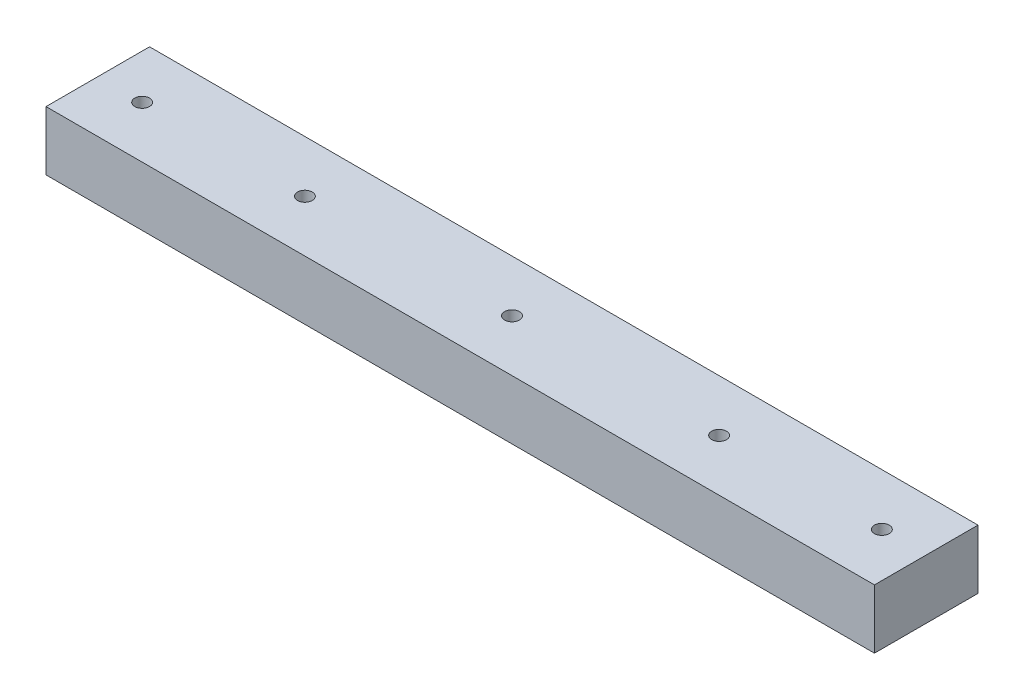
ISO-10303-21;
HEADER;
FILE_DESCRIPTION(('STEP AP214'),'2;1');
FILE_NAME('part.step','',(''),(''),'','','');
FILE_SCHEMA(('AUTOMOTIVE_DESIGN { 1 0 10303 214 1 1 1 1 }'));
ENDSEC;
DATA;
#1=APPLICATION_CONTEXT('core data for automotive mechanical design processes');
#2=APPLICATION_PROTOCOL_DEFINITION('international standard','automotive_design',2000,#1);
#3=PRODUCT_CONTEXT('',#1,'mechanical');
#4=PRODUCT('Part','Part','',(#3));
#5=PRODUCT_RELATED_PRODUCT_CATEGORY('part','',(#4));
#6=PRODUCT_DEFINITION_FORMATION('','',#4);
#7=PRODUCT_DEFINITION_CONTEXT('part definition',#1,'design');
#8=PRODUCT_DEFINITION('design','',#6,#7);
#9=PRODUCT_DEFINITION_SHAPE('','',#8);
#10=(LENGTH_UNIT() NAMED_UNIT(*) SI_UNIT(.MILLI.,.METRE.));
#11=(NAMED_UNIT(*) PLANE_ANGLE_UNIT() SI_UNIT($,.RADIAN.));
#12=(NAMED_UNIT(*) SI_UNIT($,.STERADIAN.) SOLID_ANGLE_UNIT());
#13=UNCERTAINTY_MEASURE_WITH_UNIT(LENGTH_MEASURE(1.E-05),#10,'distance_accuracy_value','');
#14=(GEOMETRIC_REPRESENTATION_CONTEXT(3) GLOBAL_UNCERTAINTY_ASSIGNED_CONTEXT((#13)) GLOBAL_UNIT_ASSIGNED_CONTEXT((#10,
#11,#12)) REPRESENTATION_CONTEXT('',''));
#15=CARTESIAN_POINT('',(0.,0.,0.));
#16=DIRECTION('',(0.,0.,1.));
#17=DIRECTION('',(1.,0.,0.));
#18=AXIS2_PLACEMENT_3D('',#15,#16,#17);
#19=CARTESIAN_POINT('',(140.,20.,-17.5));
#20=DIRECTION('',(-1.,0.,0.));
#21=DIRECTION('',(0.,0.,1.));
#22=AXIS2_PLACEMENT_3D('',#19,#20,#21);
#23=PLANE('',#22);
#24=DIRECTION('',(0.,0.,-1.));
#25=VECTOR('',#24,1.);
#26=CARTESIAN_POINT('',(140.,0.,-17.5));
#27=LINE('',#26,#25);
#28=CARTESIAN_POINT('',(140.,0.,17.5));
#29=VERTEX_POINT('',#28);
#30=CARTESIAN_POINT('',(140.,0.,-17.5));
#31=VERTEX_POINT('',#30);
#32=EDGE_CURVE('E102',#29,#31,#27,.T.);
#33=ORIENTED_EDGE('',*,*,#32,.T.);
#34=DIRECTION('',(0.,-1.,0.));
#35=VECTOR('',#34,1.);
#36=CARTESIAN_POINT('',(140.,20.,-17.5));
#37=LINE('',#36,#35);
#38=CARTESIAN_POINT('',(140.,20.,-17.5));
#39=VERTEX_POINT('',#38);
#40=EDGE_CURVE('E11',#39,#31,#37,.T.);
#41=ORIENTED_EDGE('',*,*,#40,.F.);
#42=DIRECTION('',(0.,0.,-1.));
#43=VECTOR('',#42,1.);
#44=CARTESIAN_POINT('',(140.,20.,-17.5));
#45=LINE('',#44,#43);
#46=CARTESIAN_POINT('',(140.,20.,17.5));
#47=VERTEX_POINT('',#46);
#48=EDGE_CURVE('E90',#47,#39,#45,.T.);
#49=ORIENTED_EDGE('',*,*,#48,.F.);
#50=DIRECTION('',(0.,-1.,0.));
#51=VECTOR('',#50,1.);
#52=CARTESIAN_POINT('',(140.,20.,17.5));
#53=LINE('',#52,#51);
#54=EDGE_CURVE('E98',#47,#29,#53,.T.);
#55=ORIENTED_EDGE('',*,*,#54,.T.);
#56=EDGE_LOOP('',(#33,#41,#49,#55));
#57=FACE_BOUND('',#56,.T.);
#58=ADVANCED_FACE('F39',(#57),#23,.F.);
#59=CARTESIAN_POINT('',(-140.,20.,-17.5));
#60=DIRECTION('',(0.,0.,1.));
#61=DIRECTION('',(1.,0.,0.));
#62=AXIS2_PLACEMENT_3D('',#59,#60,#61);
#63=PLANE('',#62);
#64=DIRECTION('',(-1.,0.,0.));
#65=VECTOR('',#64,1.);
#66=CARTESIAN_POINT('',(-140.,0.,-17.5));
#67=LINE('',#66,#65);
#68=CARTESIAN_POINT('',(-140.,0.,-17.5));
#69=VERTEX_POINT('',#68);
#70=EDGE_CURVE('E94',#31,#69,#67,.T.);
#71=ORIENTED_EDGE('',*,*,#70,.T.);
#72=DIRECTION('',(0.,-1.,0.));
#73=VECTOR('',#72,1.);
#74=CARTESIAN_POINT('',(-140.,20.,-17.5));
#75=LINE('',#74,#73);
#76=CARTESIAN_POINT('',(-140.,20.,-17.5));
#77=VERTEX_POINT('',#76);
#78=EDGE_CURVE('E47',#77,#69,#75,.T.);
#79=ORIENTED_EDGE('',*,*,#78,.F.);
#80=DIRECTION('',(-1.,0.,0.));
#81=VECTOR('',#80,1.);
#82=CARTESIAN_POINT('',(-140.,20.,-17.5));
#83=LINE('',#82,#81);
#84=EDGE_CURVE('E85',#39,#77,#83,.T.);
#85=ORIENTED_EDGE('',*,*,#84,.F.);
#86=ORIENTED_EDGE('',*,*,#40,.T.);
#87=EDGE_LOOP('',(#71,#79,#85,#86));
#88=FACE_BOUND('',#87,.T.);
#89=ADVANCED_FACE('F93',(#88),#63,.F.);
#90=CARTESIAN_POINT('',(-140.,20.,-17.5));
#91=DIRECTION('',(1.,0.,0.));
#92=DIRECTION('',(0.,0.,-1.));
#93=AXIS2_PLACEMENT_3D('',#90,#91,#92);
#94=PLANE('',#93);
#95=DIRECTION('',(0.,0.,1.));
#96=VECTOR('',#95,1.);
#97=CARTESIAN_POINT('',(-140.,0.,-17.5));
#98=LINE('',#97,#96);
#99=CARTESIAN_POINT('',(-140.,0.,17.5));
#100=VERTEX_POINT('',#99);
#101=EDGE_CURVE('E72',#69,#100,#98,.T.);
#102=ORIENTED_EDGE('',*,*,#101,.T.);
#103=DIRECTION('',(0.,-1.,0.));
#104=VECTOR('',#103,1.);
#105=CARTESIAN_POINT('',(-140.,20.,17.5));
#106=LINE('',#105,#104);
#107=CARTESIAN_POINT('',(-140.,20.,17.5));
#108=VERTEX_POINT('',#107);
#109=EDGE_CURVE('E95',#108,#100,#106,.T.);
#110=ORIENTED_EDGE('',*,*,#109,.F.);
#111=DIRECTION('',(0.,0.,1.));
#112=VECTOR('',#111,1.);
#113=CARTESIAN_POINT('',(-140.,20.,-17.5));
#114=LINE('',#113,#112);
#115=EDGE_CURVE('E88',#77,#108,#114,.T.);
#116=ORIENTED_EDGE('',*,*,#115,.F.);
#117=ORIENTED_EDGE('',*,*,#78,.T.);
#118=EDGE_LOOP('',(#102,#110,#116,#117));
#119=FACE_BOUND('',#118,.T.);
#120=ADVANCED_FACE('F96',(#119),#94,.F.);
#121=CARTESIAN_POINT('',(-140.,20.,17.5));
#122=DIRECTION('',(0.,0.,-1.));
#123=DIRECTION('',(-1.,0.,0.));
#124=AXIS2_PLACEMENT_3D('',#121,#122,#123);
#125=PLANE('',#124);
#126=DIRECTION('',(1.,0.,0.));
#127=VECTOR('',#126,1.);
#128=CARTESIAN_POINT('',(-140.,0.,17.5));
#129=LINE('',#128,#127);
#130=EDGE_CURVE('E78',#100,#29,#129,.T.);
#131=ORIENTED_EDGE('',*,*,#130,.T.);
#132=ORIENTED_EDGE('',*,*,#54,.F.);
#133=DIRECTION('',(1.,0.,0.));
#134=VECTOR('',#133,1.);
#135=CARTESIAN_POINT('',(-140.,20.,17.5));
#136=LINE('',#135,#134);
#137=EDGE_CURVE('E55',#108,#47,#136,.T.);
#138=ORIENTED_EDGE('',*,*,#137,.F.);
#139=ORIENTED_EDGE('',*,*,#109,.T.);
#140=EDGE_LOOP('',(#131,#132,#138,#139));
#141=FACE_BOUND('',#140,.T.);
#142=ADVANCED_FACE('F110',(#141),#125,.F.);
#143=CARTESIAN_POINT('',(0.,20.,0.));
#144=DIRECTION('',(0.,1.,0.));
#145=DIRECTION('',(0.,0.,1.));
#146=AXIS2_PLACEMENT_3D('',#143,#144,#145);
#147=PLANE('',#146);
#148=CARTESIAN_POINT('',(125.,20.,0.));
#149=DIRECTION('',(0.,1.,0.));
#150=DIRECTION('',(0.,0.,1.));
#151=AXIS2_PLACEMENT_3D('',#148,#149,#150);
#152=CIRCLE('',#151,2.5);
#153=CARTESIAN_POINT('',(125.,20.,2.49999999999995));
#154=VERTEX_POINT('',#153);
#155=EDGE_CURVE('E139',#154,#154,#152,.T.);
#156=ORIENTED_EDGE('',*,*,#155,.F.);
#157=EDGE_LOOP('',(#156));
#158=FACE_BOUND('',#157,.T.);
#159=CARTESIAN_POINT('',(70.,20.,0.));
#160=DIRECTION('',(0.,1.,0.));
#161=DIRECTION('',(0.,0.,1.));
#162=AXIS2_PLACEMENT_3D('',#159,#160,#161);
#163=CIRCLE('',#162,2.49999999999999);
#164=CARTESIAN_POINT('',(70.,20.,2.49999999999993));
#165=VERTEX_POINT('',#164);
#166=EDGE_CURVE('E133',#165,#165,#163,.T.);
#167=ORIENTED_EDGE('',*,*,#166,.F.);
#168=EDGE_LOOP('',(#167));
#169=FACE_BOUND('',#168,.T.);
#170=CARTESIAN_POINT('',(0.,20.,0.));
#171=DIRECTION('',(0.,1.,0.));
#172=DIRECTION('',(0.,0.,1.));
#173=AXIS2_PLACEMENT_3D('',#170,#171,#172);
#174=CIRCLE('',#173,2.49999999999999);
#175=CARTESIAN_POINT('',(0.,20.,2.49999999999999));
#176=VERTEX_POINT('',#175);
#177=EDGE_CURVE('E127',#176,#176,#174,.T.);
#178=ORIENTED_EDGE('',*,*,#177,.F.);
#179=EDGE_LOOP('',(#178));
#180=FACE_BOUND('',#179,.T.);
#181=CARTESIAN_POINT('',(-70.0000000000001,20.,0.));
#182=DIRECTION('',(0.,1.,0.));
#183=DIRECTION('',(0.,0.,1.));
#184=AXIS2_PLACEMENT_3D('',#181,#182,#183);
#185=CIRCLE('',#184,2.49999999999999);
#186=CARTESIAN_POINT('',(-70.0000000000001,20.,2.49999999999993));
#187=VERTEX_POINT('',#186);
#188=EDGE_CURVE('E121',#187,#187,#185,.T.);
#189=ORIENTED_EDGE('',*,*,#188,.F.);
#190=EDGE_LOOP('',(#189));
#191=FACE_BOUND('',#190,.T.);
#192=CARTESIAN_POINT('',(-125.,20.,0.));
#193=DIRECTION('',(0.,1.,0.));
#194=DIRECTION('',(0.,0.,1.));
#195=AXIS2_PLACEMENT_3D('',#192,#193,#194);
#196=CIRCLE('',#195,2.49999999999999);
#197=CARTESIAN_POINT('',(-125.,20.,2.49999999999993));
#198=VERTEX_POINT('',#197);
#199=EDGE_CURVE('E105',#198,#198,#196,.T.);
#200=ORIENTED_EDGE('',*,*,#199,.F.);
#201=EDGE_LOOP('',(#200));
#202=FACE_BOUND('',#201,.T.);
#203=ORIENTED_EDGE('',*,*,#48,.T.);
#204=ORIENTED_EDGE('',*,*,#84,.T.);
#205=ORIENTED_EDGE('',*,*,#115,.T.);
#206=ORIENTED_EDGE('',*,*,#137,.T.);
#207=EDGE_LOOP('',(#203,#204,#205,#206));
#208=FACE_BOUND('',#207,.T.);
#209=ADVANCED_FACE('F86',(#158,#169,#180,#191,#202,#208),#147,.T.);
#210=CARTESIAN_POINT('',(0.,0.,0.));
#211=DIRECTION('',(0.,1.,0.));
#212=DIRECTION('',(0.,0.,1.));
#213=AXIS2_PLACEMENT_3D('',#210,#211,#212);
#214=PLANE('',#213);
#215=CARTESIAN_POINT('',(125.,0.,0.));
#216=DIRECTION('',(0.,-1.,0.));
#217=DIRECTION('',(0.,0.,-1.));
#218=AXIS2_PLACEMENT_3D('',#215,#216,#217);
#219=CIRCLE('',#218,2.5);
#220=CARTESIAN_POINT('',(125.,0.,-2.50000000000006));
#221=VERTEX_POINT('',#220);
#222=EDGE_CURVE('E142',#221,#221,#219,.T.);
#223=ORIENTED_EDGE('',*,*,#222,.F.);
#224=EDGE_LOOP('',(#223));
#225=FACE_BOUND('',#224,.T.);
#226=CARTESIAN_POINT('',(70.,0.,0.));
#227=DIRECTION('',(0.,-1.,0.));
#228=DIRECTION('',(0.,0.,-1.));
#229=AXIS2_PLACEMENT_3D('',#226,#227,#228);
#230=CIRCLE('',#229,2.49999999999999);
#231=CARTESIAN_POINT('',(70.,0.,-2.50000000000004));
#232=VERTEX_POINT('',#231);
#233=EDGE_CURVE('E136',#232,#232,#230,.T.);
#234=ORIENTED_EDGE('',*,*,#233,.F.);
#235=EDGE_LOOP('',(#234));
#236=FACE_BOUND('',#235,.T.);
#237=CARTESIAN_POINT('',(0.,0.,0.));
#238=DIRECTION('',(0.,-1.,0.));
#239=DIRECTION('',(0.,0.,-1.));
#240=AXIS2_PLACEMENT_3D('',#237,#238,#239);
#241=CIRCLE('',#240,2.49999999999999);
#242=CARTESIAN_POINT('',(0.,0.,-2.49999999999999));
#243=VERTEX_POINT('',#242);
#244=EDGE_CURVE('E130',#243,#243,#241,.T.);
#245=ORIENTED_EDGE('',*,*,#244,.F.);
#246=EDGE_LOOP('',(#245));
#247=FACE_BOUND('',#246,.T.);
#248=CARTESIAN_POINT('',(-70.0000000000001,0.,0.));
#249=DIRECTION('',(0.,-1.,0.));
#250=DIRECTION('',(0.,0.,-1.));
#251=AXIS2_PLACEMENT_3D('',#248,#249,#250);
#252=CIRCLE('',#251,2.49999999999999);
#253=CARTESIAN_POINT('',(-70.0000000000001,0.,-2.50000000000004));
#254=VERTEX_POINT('',#253);
#255=EDGE_CURVE('E124',#254,#254,#252,.T.);
#256=ORIENTED_EDGE('',*,*,#255,.F.);
#257=EDGE_LOOP('',(#256));
#258=FACE_BOUND('',#257,.T.);
#259=CARTESIAN_POINT('',(-125.,0.,0.));
#260=DIRECTION('',(0.,-1.,0.));
#261=DIRECTION('',(0.,0.,-1.));
#262=AXIS2_PLACEMENT_3D('',#259,#260,#261);
#263=CIRCLE('',#262,2.49999999999999);
#264=CARTESIAN_POINT('',(-125.,0.,-2.50000000000004));
#265=VERTEX_POINT('',#264);
#266=EDGE_CURVE('E118',#265,#265,#263,.T.);
#267=ORIENTED_EDGE('',*,*,#266,.F.);
#268=EDGE_LOOP('',(#267));
#269=FACE_BOUND('',#268,.T.);
#270=ORIENTED_EDGE('',*,*,#32,.F.);
#271=ORIENTED_EDGE('',*,*,#130,.F.);
#272=ORIENTED_EDGE('',*,*,#101,.F.);
#273=ORIENTED_EDGE('',*,*,#70,.F.);
#274=EDGE_LOOP('',(#270,#271,#272,#273));
#275=FACE_BOUND('',#274,.T.);
#276=ADVANCED_FACE('F113',(#225,#236,#247,#258,#269,#275),#214,.F.);
#277=CARTESIAN_POINT('',(-125.,0.,0.));
#278=DIRECTION('',(0.,-1.,0.));
#279=DIRECTION('',(0.,0.,-1.));
#280=AXIS2_PLACEMENT_3D('',#277,#278,#279);
#281=CYLINDRICAL_SURFACE('',#280,2.49999999999999);
#282=ORIENTED_EDGE('',*,*,#199,.T.);
#283=EDGE_LOOP('',(#282));
#284=FACE_BOUND('',#283,.T.);
#285=ORIENTED_EDGE('',*,*,#266,.T.);
#286=EDGE_LOOP('',(#285));
#287=FACE_BOUND('',#286,.T.);
#288=ADVANCED_FACE('F150',(#284,#287),#281,.F.);
#289=CARTESIAN_POINT('',(-70.0000000000001,0.,0.));
#290=DIRECTION('',(0.,-1.,0.));
#291=DIRECTION('',(0.,0.,-1.));
#292=AXIS2_PLACEMENT_3D('',#289,#290,#291);
#293=CYLINDRICAL_SURFACE('',#292,2.49999999999999);
#294=ORIENTED_EDGE('',*,*,#188,.T.);
#295=EDGE_LOOP('',(#294));
#296=FACE_BOUND('',#295,.T.);
#297=ORIENTED_EDGE('',*,*,#255,.T.);
#298=EDGE_LOOP('',(#297));
#299=FACE_BOUND('',#298,.T.);
#300=ADVANCED_FACE('F161',(#296,#299),#293,.F.);
#301=CARTESIAN_POINT('',(0.,0.,0.));
#302=DIRECTION('',(0.,-1.,0.));
#303=DIRECTION('',(0.,0.,-1.));
#304=AXIS2_PLACEMENT_3D('',#301,#302,#303);
#305=CYLINDRICAL_SURFACE('',#304,2.49999999999999);
#306=ORIENTED_EDGE('',*,*,#177,.T.);
#307=EDGE_LOOP('',(#306));
#308=FACE_BOUND('',#307,.T.);
#309=ORIENTED_EDGE('',*,*,#244,.T.);
#310=EDGE_LOOP('',(#309));
#311=FACE_BOUND('',#310,.T.);
#312=ADVANCED_FACE('F167',(#308,#311),#305,.F.);
#313=CARTESIAN_POINT('',(70.,0.,0.));
#314=DIRECTION('',(0.,-1.,0.));
#315=DIRECTION('',(0.,0.,-1.));
#316=AXIS2_PLACEMENT_3D('',#313,#314,#315);
#317=CYLINDRICAL_SURFACE('',#316,2.49999999999999);
#318=ORIENTED_EDGE('',*,*,#166,.T.);
#319=EDGE_LOOP('',(#318));
#320=FACE_BOUND('',#319,.T.);
#321=ORIENTED_EDGE('',*,*,#233,.T.);
#322=EDGE_LOOP('',(#321));
#323=FACE_BOUND('',#322,.T.);
#324=ADVANCED_FACE('F198',(#320,#323),#317,.F.);
#325=CARTESIAN_POINT('',(125.,0.,0.));
#326=DIRECTION('',(0.,-1.,0.));
#327=DIRECTION('',(0.,0.,-1.));
#328=AXIS2_PLACEMENT_3D('',#325,#326,#327);
#329=CYLINDRICAL_SURFACE('',#328,2.5);
#330=ORIENTED_EDGE('',*,*,#155,.T.);
#331=EDGE_LOOP('',(#330));
#332=FACE_BOUND('',#331,.T.);
#333=ORIENTED_EDGE('',*,*,#222,.T.);
#334=EDGE_LOOP('',(#333));
#335=FACE_BOUND('',#334,.T.);
#336=ADVANCED_FACE('F146',(#332,#335),#329,.F.);
#337=CLOSED_SHELL('',(#58,#89,#120,#142,#209,#276,#288,#300,#312,#324,#336));
#338=MANIFOLD_SOLID_BREP('B2',#337);
#339=ADVANCED_BREP_SHAPE_REPRESENTATION('',(#18,#338),#14);
#340=SHAPE_DEFINITION_REPRESENTATION(#9,#339);
ENDSEC;
END-ISO-10303-21;
